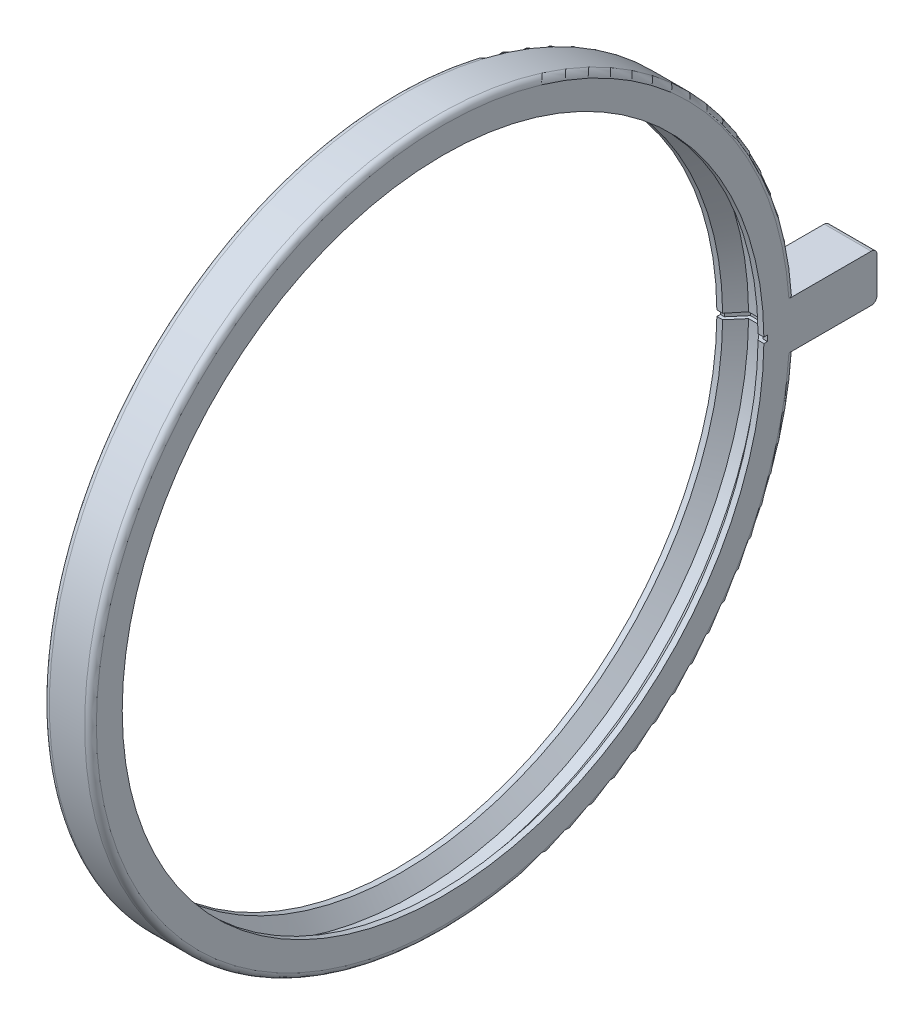
ISO-10303-21;
HEADER;
FILE_DESCRIPTION(('STEP AP214'),'2;1');
FILE_NAME('part.step','',(''),(''),'','','');
FILE_SCHEMA(('AUTOMOTIVE_DESIGN { 1 0 10303 214 1 1 1 1 }'));
ENDSEC;
DATA;
#1=APPLICATION_CONTEXT('core data for automotive mechanical design processes');
#2=APPLICATION_PROTOCOL_DEFINITION('international standard','automotive_design',2000,#1);
#3=PRODUCT_CONTEXT('',#1,'mechanical');
#4=PRODUCT('Part','Part','',(#3));
#5=PRODUCT_RELATED_PRODUCT_CATEGORY('part','',(#4));
#6=PRODUCT_DEFINITION_FORMATION('','',#4);
#7=PRODUCT_DEFINITION_CONTEXT('part definition',#1,'design');
#8=PRODUCT_DEFINITION('design','',#6,#7);
#9=PRODUCT_DEFINITION_SHAPE('','',#8);
#10=(LENGTH_UNIT() NAMED_UNIT(*) SI_UNIT(.MILLI.,.METRE.));
#11=(NAMED_UNIT(*) PLANE_ANGLE_UNIT() SI_UNIT($,.RADIAN.));
#12=(NAMED_UNIT(*) SI_UNIT($,.STERADIAN.) SOLID_ANGLE_UNIT());
#13=UNCERTAINTY_MEASURE_WITH_UNIT(LENGTH_MEASURE(1.E-05),#10,'distance_accuracy_value','');
#14=(GEOMETRIC_REPRESENTATION_CONTEXT(3) GLOBAL_UNCERTAINTY_ASSIGNED_CONTEXT((#13)) GLOBAL_UNIT_ASSIGNED_CONTEXT((#10,
#11,#12)) REPRESENTATION_CONTEXT('',''));
#15=CARTESIAN_POINT('',(0.,0.,0.));
#16=DIRECTION('',(0.,0.,1.));
#17=DIRECTION('',(1.,0.,0.));
#18=AXIS2_PLACEMENT_3D('',#15,#16,#17);
#19=CARTESIAN_POINT('',(0.,0.,0.));
#20=DIRECTION('',(-1.,0.,0.));
#21=DIRECTION('',(0.,0.,1.));
#22=AXIS2_PLACEMENT_3D('',#19,#20,#21);
#23=CYLINDRICAL_SURFACE('',#22,30.);
#24=DIRECTION('',(-1.,0.,0.));
#25=VECTOR('',#24,1.);
#26=CARTESIAN_POINT('',(2.,-2.,-29.9332590941915));
#27=LINE('',#26,#25);
#28=CARTESIAN_POINT('',(1.5,-2.,-29.9332590941915));
#29=VERTEX_POINT('',#28);
#30=CARTESIAN_POINT('',(-1.5,-2.,-29.9332590941915));
#31=VERTEX_POINT('',#30);
#32=EDGE_CURVE('E268',#29,#31,#27,.T.);
#33=ORIENTED_EDGE('',*,*,#32,.F.);
#34=CARTESIAN_POINT('',(1.5,0.,0.));
#35=DIRECTION('',(-1.,0.,0.));
#36=DIRECTION('',(0.,0.,1.));
#37=AXIS2_PLACEMENT_3D('',#34,#35,#36);
#38=CIRCLE('',#37,30.);
#39=CARTESIAN_POINT('',(1.5,2.,-29.9332590941915));
#40=VERTEX_POINT('',#39);
#41=EDGE_CURVE('E314',#29,#40,#38,.T.);
#42=ORIENTED_EDGE('',*,*,#41,.T.);
#43=DIRECTION('',(-1.,0.,0.));
#44=VECTOR('',#43,1.);
#45=CARTESIAN_POINT('',(2.,2.,-29.9332590941915));
#46=LINE('',#45,#44);
#47=CARTESIAN_POINT('',(-1.5,2.,-29.9332590941915));
#48=VERTEX_POINT('',#47);
#49=EDGE_CURVE('E275',#40,#48,#46,.T.);
#50=ORIENTED_EDGE('',*,*,#49,.T.);
#51=CARTESIAN_POINT('',(-1.5,0.,0.));
#52=DIRECTION('',(1.,0.,0.));
#53=DIRECTION('',(0.,0.,-1.));
#54=AXIS2_PLACEMENT_3D('',#51,#52,#53);
#55=CIRCLE('',#54,30.);
#56=EDGE_CURVE('E312',#48,#31,#55,.T.);
#57=ORIENTED_EDGE('',*,*,#56,.T.);
#58=EDGE_LOOP('',(#33,#42,#50,#57));
#59=FACE_BOUND('',#58,.T.);
#60=ADVANCED_FACE('F43',(#59),#23,.T.);
#61=CARTESIAN_POINT('',(0.,0.,0.));
#62=DIRECTION('',(-1.,0.,0.));
#63=DIRECTION('',(0.,0.,1.));
#64=AXIS2_PLACEMENT_3D('',#61,#62,#63);
#65=CYLINDRICAL_SURFACE('',#64,28.5);
#66=DIRECTION('',(1.,0.,0.));
#67=VECTOR('',#66,1.);
#68=CARTESIAN_POINT('',(-0.5,0.248706261703658,-28.4989148073289));
#69=LINE('',#68,#67);
#70=CARTESIAN_POINT('',(-0.5,0.248706261703658,-28.4989148073289));
#71=VERTEX_POINT('',#70);
#72=CARTESIAN_POINT('',(0.5,0.248706261703658,-28.4989148073289));
#73=VERTEX_POINT('',#72);
#74=EDGE_CURVE('E245',#71,#73,#69,.T.);
#75=ORIENTED_EDGE('',*,*,#74,.T.);
#76=CARTESIAN_POINT('',(0.499999999999997,0.,0.));
#77=DIRECTION('',(-1.,0.,0.));
#78=DIRECTION('',(0.,0.,1.));
#79=AXIS2_PLACEMENT_3D('',#76,#77,#78);
#80=CIRCLE('',#79,28.5);
#81=CARTESIAN_POINT('',(0.5,-0.248706261703658,-28.4989148073289));
#82=VERTEX_POINT('',#81);
#83=EDGE_CURVE('E278',#82,#73,#80,.T.);
#84=ORIENTED_EDGE('',*,*,#83,.F.);
#85=DIRECTION('',(1.,0.,0.));
#86=VECTOR('',#85,1.);
#87=CARTESIAN_POINT('',(-0.5,-0.248706261703658,-28.4989148073289));
#88=LINE('',#87,#86);
#89=CARTESIAN_POINT('',(-0.5,-0.248706261703658,-28.4989148073289));
#90=VERTEX_POINT('',#89);
#91=EDGE_CURVE('E226',#90,#82,#88,.T.);
#92=ORIENTED_EDGE('',*,*,#91,.F.);
#93=CARTESIAN_POINT('',(-0.499999999999997,0.,0.));
#94=DIRECTION('',(-1.,0.,0.));
#95=DIRECTION('',(0.,0.,1.));
#96=AXIS2_PLACEMENT_3D('',#93,#94,#95);
#97=CIRCLE('',#96,28.5);
#98=EDGE_CURVE('E286',#90,#71,#97,.T.);
#99=ORIENTED_EDGE('',*,*,#98,.T.);
#100=EDGE_LOOP('',(#75,#84,#92,#99));
#101=FACE_BOUND('',#100,.T.);
#102=ADVANCED_FACE('F353',(#101),#65,.F.);
#103=CARTESIAN_POINT('',(-2.,0.,0.));
#104=DIRECTION('',(1.,0.,0.));
#105=DIRECTION('',(0.,0.,-1.));
#106=AXIS2_PLACEMENT_3D('',#103,#104,#105);
#107=PLANE('',#106);
#108=CARTESIAN_POINT('',(-2.,0.,0.));
#109=DIRECTION('',(1.,0.,0.));
#110=DIRECTION('',(0.,0.,-1.));
#111=AXIS2_PLACEMENT_3D('',#108,#109,#110);
#112=CIRCLE('',#111,29.5);
#113=CARTESIAN_POINT('',(-2.,-2.,-29.4321253055229));
#114=VERTEX_POINT('',#113);
#115=CARTESIAN_POINT('',(-2.,2.,-29.4321253055229));
#116=VERTEX_POINT('',#115);
#117=EDGE_CURVE('E320',#114,#116,#112,.F.);
#118=ORIENTED_EDGE('',*,*,#117,.T.);
#119=DIRECTION('',(0.,0.,1.));
#120=VECTOR('',#119,1.);
#121=CARTESIAN_POINT('',(-2.,2.,-36.9332590941915));
#122=LINE('',#121,#120);
#123=CARTESIAN_POINT('',(-2.,2.,-36.4332590941915));
#124=VERTEX_POINT('',#123);
#125=EDGE_CURVE('E64',#124,#116,#122,.T.);
#126=ORIENTED_EDGE('',*,*,#125,.F.);
#127=CARTESIAN_POINT('',(-2.,1.5,-36.4332590941915));
#128=DIRECTION('',(1.,0.,0.));
#129=DIRECTION('',(0.,0.,-1.));
#130=AXIS2_PLACEMENT_3D('',#127,#128,#129);
#131=CIRCLE('',#130,0.5);
#132=CARTESIAN_POINT('',(-2.,1.5,-36.9332590941915));
#133=VERTEX_POINT('',#132);
#134=EDGE_CURVE('E300',#124,#133,#131,.F.);
#135=ORIENTED_EDGE('',*,*,#134,.T.);
#136=DIRECTION('',(0.,1.,0.));
#137=VECTOR('',#136,1.);
#138=CARTESIAN_POINT('',(-2.,-2.,-36.9332590941915));
#139=LINE('',#138,#137);
#140=CARTESIAN_POINT('',(-2.,-1.5,-36.9332590941915));
#141=VERTEX_POINT('',#140);
#142=EDGE_CURVE('E262',#141,#133,#139,.T.);
#143=ORIENTED_EDGE('',*,*,#142,.F.);
#144=CARTESIAN_POINT('',(-2.,-1.5,-36.4332590941915));
#145=DIRECTION('',(1.,0.,0.));
#146=DIRECTION('',(0.,0.,-1.));
#147=AXIS2_PLACEMENT_3D('',#144,#145,#146);
#148=CIRCLE('',#147,0.5);
#149=CARTESIAN_POINT('',(-2.,-2.,-36.4332590941915));
#150=VERTEX_POINT('',#149);
#151=EDGE_CURVE('E302',#141,#150,#148,.F.);
#152=ORIENTED_EDGE('',*,*,#151,.T.);
#153=DIRECTION('',(0.,0.,-1.));
#154=VECTOR('',#153,1.);
#155=CARTESIAN_POINT('',(-2.,-2.,-29.9332590941915));
#156=LINE('',#155,#154);
#157=EDGE_CURVE('E72',#114,#150,#156,.T.);
#158=ORIENTED_EDGE('',*,*,#157,.F.);
#159=EDGE_LOOP('',(#118,#126,#135,#143,#152,#158));
#160=FACE_BOUND('',#159,.T.);
#161=CARTESIAN_POINT('',(-2.,0.,0.));
#162=DIRECTION('',(-1.,0.,0.));
#163=DIRECTION('',(0.,0.,1.));
#164=AXIS2_PLACEMENT_3D('',#161,#162,#163);
#165=CIRCLE('',#164,27.6);
#166=CARTESIAN_POINT('',(-2.,0.240852379755121,-27.5989490765711));
#167=VERTEX_POINT('',#166);
#168=CARTESIAN_POINT('',(-2.,-0.240852379755121,-27.5989490765711));
#169=VERTEX_POINT('',#168);
#170=EDGE_CURVE('E257',#167,#169,#165,.T.);
#171=ORIENTED_EDGE('',*,*,#170,.F.);
#172=DIRECTION('',(0.,-0.00872653549837396,0.999961923064171));
#173=VECTOR('',#172,1.);
#174=CARTESIAN_POINT('',(-2.,0.240852379755121,-27.5989490765711));
#175=LINE('',#174,#173);
#176=CARTESIAN_POINT('',(-2.,0.238234419105609,-27.2989604996519));
#177=VERTEX_POINT('',#176);
#178=EDGE_CURVE('E236',#167,#177,#175,.T.);
#179=ORIENTED_EDGE('',*,*,#178,.T.);
#180=CARTESIAN_POINT('',(-2.,0.,0.));
#181=DIRECTION('',(-1.,0.,0.));
#182=DIRECTION('',(0.,0.,1.));
#183=AXIS2_PLACEMENT_3D('',#180,#181,#182);
#184=CIRCLE('',#183,27.3);
#185=CARTESIAN_POINT('',(-2.,-0.238234419105609,-27.2989604996519));
#186=VERTEX_POINT('',#185);
#187=EDGE_CURVE('E292',#186,#177,#184,.T.);
#188=ORIENTED_EDGE('',*,*,#187,.F.);
#189=DIRECTION('',(0.,0.00872653549837395,0.999961923064171));
#190=VECTOR('',#189,1.);
#191=CARTESIAN_POINT('',(-2.,-0.240852379755121,-27.5989490765711));
#192=LINE('',#191,#190);
#193=EDGE_CURVE('E215',#169,#186,#192,.T.);
#194=ORIENTED_EDGE('',*,*,#193,.F.);
#195=EDGE_LOOP('',(#171,#179,#188,#194));
#196=FACE_BOUND('',#195,.T.);
#197=ADVANCED_FACE('F356',(#160,#196),#107,.F.);
#198=CARTESIAN_POINT('',(0.,0.,0.));
#199=DIRECTION('',(-1.,0.,0.));
#200=DIRECTION('',(0.,0.,1.));
#201=AXIS2_PLACEMENT_3D('',#198,#199,#200);
#202=CYLINDRICAL_SURFACE('',#201,27.3);
#203=ORIENTED_EDGE('',*,*,#187,.T.);
#204=DIRECTION('',(1.,0.,0.));
#205=VECTOR('',#204,1.);
#206=CARTESIAN_POINT('',(-2.,0.238234419105609,-27.2989604996519));
#207=LINE('',#206,#205);
#208=CARTESIAN_POINT('',(-1.50691955741273,0.238234419105609,-27.2989604996519));
#209=VERTEX_POINT('',#208);
#210=EDGE_CURVE('E239',#177,#209,#207,.T.);
#211=ORIENTED_EDGE('',*,*,#210,.T.);
#212=CARTESIAN_POINT('',(-1.50691955741273,0.,0.));
#213=DIRECTION('',(-1.,0.,0.));
#214=DIRECTION('',(0.,0.,1.));
#215=AXIS2_PLACEMENT_3D('',#212,#213,#214);
#216=CIRCLE('',#215,27.3);
#217=CARTESIAN_POINT('',(-1.50691955741273,-0.238234419105609,-27.2989604996519));
#218=VERTEX_POINT('',#217);
#219=EDGE_CURVE('E289',#218,#209,#216,.T.);
#220=ORIENTED_EDGE('',*,*,#219,.F.);
#221=DIRECTION('',(1.,0.,0.));
#222=VECTOR('',#221,1.);
#223=CARTESIAN_POINT('',(-2.,-0.238234419105609,-27.2989604996519));
#224=LINE('',#223,#222);
#225=EDGE_CURVE('E222',#186,#218,#224,.T.);
#226=ORIENTED_EDGE('',*,*,#225,.F.);
#227=EDGE_LOOP('',(#203,#211,#220,#226));
#228=FACE_BOUND('',#227,.T.);
#229=ADVANCED_FACE('F363',(#228),#202,.F.);
#230=CARTESIAN_POINT('',(-1.50691955741273,0.,0.));
#231=DIRECTION('',(1.,0.,0.));
#232=DIRECTION('',(0.,0.,-1.));
#233=AXIS2_PLACEMENT_3D('',#230,#231,#232);
#234=CONICAL_SURFACE('',#233,27.3,0.872664625997165);
#235=ORIENTED_EDGE('',*,*,#219,.T.);
#236=DIRECTION('',(0.642787609686538,0.00668491402620988,-0.766015274493877));
#237=VECTOR('',#236,1.);
#238=CARTESIAN_POINT('',(-1.50691955741273,0.238234419105609,-27.2989604996519));
#239=LINE('',#238,#237);
#240=EDGE_CURVE('E242',#209,#71,#239,.T.);
#241=ORIENTED_EDGE('',*,*,#240,.T.);
#242=ORIENTED_EDGE('',*,*,#98,.F.);
#243=DIRECTION('',(0.642787609686538,-0.00668491402620988,-0.766015274493877));
#244=VECTOR('',#243,1.);
#245=CARTESIAN_POINT('',(-1.50691955741273,-0.238234419105609,-27.2989604996519));
#246=LINE('',#245,#244);
#247=EDGE_CURVE('E224',#218,#90,#246,.T.);
#248=ORIENTED_EDGE('',*,*,#247,.F.);
#249=EDGE_LOOP('',(#235,#241,#242,#248));
#250=FACE_BOUND('',#249,.T.);
#251=ADVANCED_FACE('F366',(#250),#234,.F.);
#252=CARTESIAN_POINT('',(2.,0.,0.));
#253=DIRECTION('',(-1.,0.,0.));
#254=DIRECTION('',(0.,0.,-1.));
#255=AXIS2_PLACEMENT_3D('',#252,#253,#254);
#256=PLANE('',#255);
#257=DIRECTION('',(0.,0.,1.));
#258=VECTOR('',#257,1.);
#259=CARTESIAN_POINT('',(2.,2.,-36.9332590941915));
#260=LINE('',#259,#258);
#261=CARTESIAN_POINT('',(2.,2.,-36.4332590941915));
#262=VERTEX_POINT('',#261);
#263=CARTESIAN_POINT('',(2.,2.,-29.4321253055229));
#264=VERTEX_POINT('',#263);
#265=EDGE_CURVE('E259',#262,#264,#260,.T.);
#266=ORIENTED_EDGE('',*,*,#265,.T.);
#267=CARTESIAN_POINT('',(2.,0.,0.));
#268=DIRECTION('',(-1.,0.,0.));
#269=DIRECTION('',(0.,0.,1.));
#270=AXIS2_PLACEMENT_3D('',#267,#268,#269);
#271=CIRCLE('',#270,29.5);
#272=CARTESIAN_POINT('',(2.,-2.,-29.4321253055229));
#273=VERTEX_POINT('',#272);
#274=EDGE_CURVE('E317',#264,#273,#271,.F.);
#275=ORIENTED_EDGE('',*,*,#274,.T.);
#276=DIRECTION('',(0.,0.,-1.));
#277=VECTOR('',#276,1.);
#278=CARTESIAN_POINT('',(2.,-2.,-29.9332590941915));
#279=LINE('',#278,#277);
#280=CARTESIAN_POINT('',(2.,-2.,-36.4332590941915));
#281=VERTEX_POINT('',#280);
#282=EDGE_CURVE('E261',#273,#281,#279,.T.);
#283=ORIENTED_EDGE('',*,*,#282,.T.);
#284=CARTESIAN_POINT('',(2.,-1.5,-36.4332590941915));
#285=DIRECTION('',(-1.,0.,0.));
#286=DIRECTION('',(0.,0.,1.));
#287=AXIS2_PLACEMENT_3D('',#284,#285,#286);
#288=CIRCLE('',#287,0.5);
#289=CARTESIAN_POINT('',(2.,-1.5,-36.9332590941915));
#290=VERTEX_POINT('',#289);
#291=EDGE_CURVE('E308',#281,#290,#288,.F.);
#292=ORIENTED_EDGE('',*,*,#291,.T.);
#293=DIRECTION('',(0.,1.,0.));
#294=VECTOR('',#293,1.);
#295=CARTESIAN_POINT('',(2.,-2.,-36.9332590941915));
#296=LINE('',#295,#294);
#297=CARTESIAN_POINT('',(2.,1.5,-36.9332590941915));
#298=VERTEX_POINT('',#297);
#299=EDGE_CURVE('E265',#290,#298,#296,.T.);
#300=ORIENTED_EDGE('',*,*,#299,.T.);
#301=CARTESIAN_POINT('',(2.,1.5,-36.4332590941915));
#302=DIRECTION('',(-1.,0.,0.));
#303=DIRECTION('',(0.,0.,1.));
#304=AXIS2_PLACEMENT_3D('',#301,#302,#303);
#305=CIRCLE('',#304,0.5);
#306=EDGE_CURVE('E306',#298,#262,#305,.F.);
#307=ORIENTED_EDGE('',*,*,#306,.T.);
#308=EDGE_LOOP('',(#266,#275,#283,#292,#300,#307));
#309=FACE_BOUND('',#308,.T.);
#310=CARTESIAN_POINT('',(2.,0.,0.));
#311=DIRECTION('',(-1.,0.,0.));
#312=DIRECTION('',(0.,0.,1.));
#313=AXIS2_PLACEMENT_3D('',#310,#311,#312);
#314=CIRCLE('',#313,27.3);
#315=CARTESIAN_POINT('',(2.,-0.238234419105609,-27.2989604996519));
#316=VERTEX_POINT('',#315);
#317=CARTESIAN_POINT('',(2.,0.238234419105609,-27.2989604996519));
#318=VERTEX_POINT('',#317);
#319=EDGE_CURVE('E281',#316,#318,#314,.T.);
#320=ORIENTED_EDGE('',*,*,#319,.T.);
#321=DIRECTION('',(0.,-0.00872653549837396,0.999961923064171));
#322=VECTOR('',#321,1.);
#323=CARTESIAN_POINT('',(2.,0.240852379755121,-27.5989490765711));
#324=LINE('',#323,#322);
#325=CARTESIAN_POINT('',(2.,0.240852379755121,-27.5989490765711));
#326=VERTEX_POINT('',#325);
#327=EDGE_CURVE('E211',#326,#318,#324,.T.);
#328=ORIENTED_EDGE('',*,*,#327,.F.);
#329=CARTESIAN_POINT('',(2.,0.,0.));
#330=DIRECTION('',(-1.,0.,0.));
#331=DIRECTION('',(0.,0.,1.));
#332=AXIS2_PLACEMENT_3D('',#329,#330,#331);
#333=CIRCLE('',#332,27.6);
#334=CARTESIAN_POINT('',(2.,-0.240852379755121,-27.5989490765711));
#335=VERTEX_POINT('',#334);
#336=EDGE_CURVE('E205',#326,#335,#333,.T.);
#337=ORIENTED_EDGE('',*,*,#336,.T.);
#338=DIRECTION('',(0.,0.00872653549837395,0.999961923064171));
#339=VECTOR('',#338,1.);
#340=CARTESIAN_POINT('',(2.,-0.240852379755121,-27.5989490765711));
#341=LINE('',#340,#339);
#342=EDGE_CURVE('E187',#335,#316,#341,.T.);
#343=ORIENTED_EDGE('',*,*,#342,.T.);
#344=EDGE_LOOP('',(#320,#328,#337,#343));
#345=FACE_BOUND('',#344,.T.);
#346=ADVANCED_FACE('F210',(#309,#345),#256,.F.);
#347=CARTESIAN_POINT('',(0.,0.,0.));
#348=DIRECTION('',(1.,0.,0.));
#349=DIRECTION('',(0.,0.,1.));
#350=AXIS2_PLACEMENT_3D('',#347,#348,#349);
#351=CYLINDRICAL_SURFACE('',#350,27.3);
#352=CARTESIAN_POINT('',(1.50691955741273,0.,0.));
#353=DIRECTION('',(-1.,0.,0.));
#354=DIRECTION('',(0.,0.,1.));
#355=AXIS2_PLACEMENT_3D('',#352,#353,#354);
#356=CIRCLE('',#355,27.3);
#357=CARTESIAN_POINT('',(1.50691955741273,-0.238234419105609,-27.2989604996519));
#358=VERTEX_POINT('',#357);
#359=CARTESIAN_POINT('',(1.50691955741273,0.238234419105609,-27.2989604996519));
#360=VERTEX_POINT('',#359);
#361=EDGE_CURVE('E283',#358,#360,#356,.T.);
#362=ORIENTED_EDGE('',*,*,#361,.T.);
#363=DIRECTION('',(-1.,0.,0.));
#364=VECTOR('',#363,1.);
#365=CARTESIAN_POINT('',(2.,0.238234419105609,-27.2989604996519));
#366=LINE('',#365,#364);
#367=EDGE_CURVE('E444',#318,#360,#366,.T.);
#368=ORIENTED_EDGE('',*,*,#367,.F.);
#369=ORIENTED_EDGE('',*,*,#319,.F.);
#370=DIRECTION('',(-1.,0.,0.));
#371=VECTOR('',#370,1.);
#372=CARTESIAN_POINT('',(2.,-0.238234419105609,-27.2989604996519));
#373=LINE('',#372,#371);
#374=EDGE_CURVE('E194',#316,#358,#373,.T.);
#375=ORIENTED_EDGE('',*,*,#374,.T.);
#376=EDGE_LOOP('',(#362,#368,#369,#375));
#377=FACE_BOUND('',#376,.T.);
#378=ADVANCED_FACE('F374',(#377),#351,.F.);
#379=CARTESIAN_POINT('',(1.50691955741273,0.,0.));
#380=DIRECTION('',(-1.,0.,0.));
#381=DIRECTION('',(0.,0.,-1.));
#382=AXIS2_PLACEMENT_3D('',#379,#380,#381);
#383=CONICAL_SURFACE('',#382,27.3,0.872664625997165);
#384=ORIENTED_EDGE('',*,*,#83,.T.);
#385=DIRECTION('',(-0.642787609686538,0.00668491402620988,-0.766015274493877));
#386=VECTOR('',#385,1.);
#387=CARTESIAN_POINT('',(1.50691955741273,0.238234419105609,-27.2989604996519));
#388=LINE('',#387,#386);
#389=EDGE_CURVE('E434',#360,#73,#388,.T.);
#390=ORIENTED_EDGE('',*,*,#389,.F.);
#391=ORIENTED_EDGE('',*,*,#361,.F.);
#392=DIRECTION('',(-0.642787609686538,-0.00668491402620988,-0.766015274493877));
#393=VECTOR('',#392,1.);
#394=CARTESIAN_POINT('',(1.50691955741273,-0.238234419105609,-27.2989604996519));
#395=LINE('',#394,#393);
#396=EDGE_CURVE('E435',#358,#82,#395,.T.);
#397=ORIENTED_EDGE('',*,*,#396,.T.);
#398=EDGE_LOOP('',(#384,#390,#391,#397));
#399=FACE_BOUND('',#398,.T.);
#400=ADVANCED_FACE('F371',(#399),#383,.F.);
#401=CARTESIAN_POINT('',(2.,2.,-36.9332590941915));
#402=DIRECTION('',(0.,-1.,0.));
#403=DIRECTION('',(0.,0.,-1.));
#404=AXIS2_PLACEMENT_3D('',#401,#402,#403);
#405=PLANE('',#404);
#406=ORIENTED_EDGE('',*,*,#265,.F.);
#407=DIRECTION('',(-1.,0.,0.));
#408=VECTOR('',#407,1.);
#409=CARTESIAN_POINT('',(2.,2.,-36.4332590941915));
#410=LINE('',#409,#408);
#411=EDGE_CURVE('E310',#262,#124,#410,.T.);
#412=ORIENTED_EDGE('',*,*,#411,.T.);
#413=ORIENTED_EDGE('',*,*,#125,.T.);
#414=CARTESIAN_POINT('',(-2.,2.,-29.4321253055229));
#415=CARTESIAN_POINT('',(-2.00002368069256,2.,-29.4603651042107));
#416=CARTESIAN_POINT('',(-1.997619942337,2.,-29.4885981664758));
#417=CARTESIAN_POINT('',(-1.98813168582598,2.,-29.5442466715054));
#418=CARTESIAN_POINT('',(-1.98105052269843,2.,-29.5716626856027));
#419=CARTESIAN_POINT('',(-1.96237630800987,2.,-29.6249290951014));
#420=CARTESIAN_POINT('',(-1.95078098189146,2.,-29.6507786936306));
#421=CARTESIAN_POINT('',(-1.92341435274997,2.,-29.7001569691344));
#422=CARTESIAN_POINT('',(-1.9076438659856,2.,-29.7236860985361));
#423=CARTESIAN_POINT('',(-1.87238775839565,2.,-29.7677324573108));
#424=CARTESIAN_POINT('',(-1.8529061081985,2.,-29.7882528646071));
#425=CARTESIAN_POINT('',(-1.81076303958688,2.,-29.8257273757368));
#426=CARTESIAN_POINT('',(-1.78810101311991,2.,-29.8426807960494));
#427=CARTESIAN_POINT('',(-1.74029420356309,2.,-29.8724983842107));
#428=CARTESIAN_POINT('',(-1.71515434768272,2.,-29.885370461107));
#429=CARTESIAN_POINT('',(-1.66307266133581,2.,-29.9066947635916));
#430=CARTESIAN_POINT('',(-1.63613195532413,2.,-29.9151497186943));
#431=CARTESIAN_POINT('',(-1.59085023209029,2.,-29.9252585600438));
#432=CARTESIAN_POINT('',(-1.57279801700389,2.,-29.9282569553729));
#433=CARTESIAN_POINT('',(-1.53649976818814,2.,-29.9322569250276));
#434=CARTESIAN_POINT('',(-1.51825404680307,2.,-29.9332613346435));
#435=CARTESIAN_POINT('',(-1.5,2.,-29.9332590941915));
#436=B_SPLINE_CURVE_WITH_KNOTS('',3,(#414,#415,#416,#417,#418,#419,#420,#421,#422,#423,#424,
#425,#426,#427,#428,#429,#430,#431,#432,#433,#434,#435),.UNSPECIFIED.,.F.,.F.,(4,2,2,2,2,2,2,2,
2,2,4),(0.,0.0846076997384342,0.169154777785782,0.253744511935921,0.338317720690022,
0.422800946435936,0.507300346493675,0.591634983838948,0.675917445648952,0.730713729796034,
0.785432041982399),.UNSPECIFIED.);
#437=EDGE_CURVE('E57',#116,#48,#436,.T.);
#438=ORIENTED_EDGE('',*,*,#437,.T.);
#439=ORIENTED_EDGE('',*,*,#49,.F.);
#440=CARTESIAN_POINT('',(1.5,2.,-29.9332590941915));
#441=CARTESIAN_POINT('',(1.52808358512867,2.,-29.9332832437374));
#442=CARTESIAN_POINT('',(1.55615966573787,2.,-29.9308892111206));
#443=CARTESIAN_POINT('',(1.61149371123091,2.,-29.9214434219722));
#444=CARTESIAN_POINT('',(1.63875234909917,2.,-29.9143956133538));
#445=CARTESIAN_POINT('',(1.69171077903689,2.,-29.8958160962011));
#446=CARTESIAN_POINT('',(1.71740984993781,2.,-29.8842823312807));
#447=CARTESIAN_POINT('',(1.76650569184914,2.,-29.8570715289327));
#448=CARTESIAN_POINT('',(1.78990282711411,2.,-29.8413951484776));
#449=CARTESIAN_POINT('',(1.83376101079415,2.,-29.8063271682228));
#450=CARTESIAN_POINT('',(1.85421920488227,2.,-29.7869319988048));
#451=CARTESIAN_POINT('',(1.8916014369025,2.,-29.7449844406582));
#452=CARTESIAN_POINT('',(1.90852476901737,2.,-29.7224314228907));
#453=CARTESIAN_POINT('',(1.93839251755083,2.,-29.6747590926006));
#454=CARTESIAN_POINT('',(1.95132769216377,2.,-29.6496339964351));
#455=CARTESIAN_POINT('',(1.97279971423696,2.,-29.5975765312386));
#456=CARTESIAN_POINT('',(1.98133899403255,2.,-29.5706451709941));
#457=CARTESIAN_POINT('',(1.99169618288635,2.,-29.5249837042404));
#458=CARTESIAN_POINT('',(1.99480824528633,2.,-29.5065366439966));
#459=CARTESIAN_POINT('',(1.99895991135017,2.,-29.4694373513958));
#460=CARTESIAN_POINT('',(2.00000245127979,2.,-29.4507854475362));
#461=CARTESIAN_POINT('',(2.,2.,-29.4321253055229));
#462=B_SPLINE_CURVE_WITH_KNOTS('',3,(#440,#441,#442,#443,#444,#445,#446,#447,#448,#449,#450,
#451,#452,#453,#454,#455,#456,#457,#458,#459,#460,#461),.UNSPECIFIED.,.F.,.F.,(4,2,2,2,2,2,2,2,
2,2,4),(0.,0.0841380740530654,0.168204863238539,0.252310234592144,0.336402275770863,
0.420575443631008,0.504765402585072,0.589149014530635,0.673485885036206,0.729500703388647,
0.785435990212467),.UNSPECIFIED.);
#463=EDGE_CURVE('E322',#40,#264,#462,.T.);
#464=ORIENTED_EDGE('',*,*,#463,.T.);
#465=EDGE_LOOP('',(#406,#412,#413,#438,#439,#464));
#466=FACE_BOUND('',#465,.T.);
#467=ADVANCED_FACE('F335',(#466),#405,.F.);
#468=CARTESIAN_POINT('',(2.,-2.,-29.9332590941915));
#469=DIRECTION('',(0.,1.,0.));
#470=DIRECTION('',(0.,0.,1.));
#471=AXIS2_PLACEMENT_3D('',#468,#469,#470);
#472=PLANE('',#471);
#473=ORIENTED_EDGE('',*,*,#157,.T.);
#474=DIRECTION('',(-1.,0.,0.));
#475=VECTOR('',#474,1.);
#476=CARTESIAN_POINT('',(2.,-2.,-36.4332590941915));
#477=LINE('',#476,#475);
#478=EDGE_CURVE('E304',#150,#281,#477,.F.);
#479=ORIENTED_EDGE('',*,*,#478,.T.);
#480=ORIENTED_EDGE('',*,*,#282,.F.);
#481=CARTESIAN_POINT('',(2.,-2.,-29.4321253055229));
#482=CARTESIAN_POINT('',(2.00002368069256,-2.,-29.4603651042107));
#483=CARTESIAN_POINT('',(1.997619942337,-2.,-29.4885981664758));
#484=CARTESIAN_POINT('',(1.98813168582598,-2.,-29.5442466715054));
#485=CARTESIAN_POINT('',(1.98105052269843,-2.,-29.5716626856027));
#486=CARTESIAN_POINT('',(1.96237630800987,-2.,-29.6249290951014));
#487=CARTESIAN_POINT('',(1.95078098189146,-2.,-29.6507786936306));
#488=CARTESIAN_POINT('',(1.92341435274997,-2.,-29.7001569691344));
#489=CARTESIAN_POINT('',(1.9076438659856,-2.,-29.7236860985361));
#490=CARTESIAN_POINT('',(1.87238775839565,-2.,-29.7677324573108));
#491=CARTESIAN_POINT('',(1.8529061081985,-2.,-29.7882528646071));
#492=CARTESIAN_POINT('',(1.81076303958688,-2.,-29.8257273757368));
#493=CARTESIAN_POINT('',(1.78810101311991,-2.,-29.8426807960494));
#494=CARTESIAN_POINT('',(1.74029420356309,-2.,-29.8724983842107));
#495=CARTESIAN_POINT('',(1.71515434768272,-2.,-29.885370461107));
#496=CARTESIAN_POINT('',(1.66307266133581,-2.,-29.9066947635916));
#497=CARTESIAN_POINT('',(1.63613195532413,-2.,-29.9151497186943));
#498=CARTESIAN_POINT('',(1.59085023209029,-2.,-29.9252585600438));
#499=CARTESIAN_POINT('',(1.57279801700389,-2.,-29.9282569553729));
#500=CARTESIAN_POINT('',(1.53649976818814,-2.,-29.9322569250276));
#501=CARTESIAN_POINT('',(1.51825404680307,-2.,-29.9332613346435));
#502=CARTESIAN_POINT('',(1.5,-2.,-29.9332590941915));
#503=B_SPLINE_CURVE_WITH_KNOTS('',3,(#481,#482,#483,#484,#485,#486,#487,#488,#489,#490,#491,
#492,#493,#494,#495,#496,#497,#498,#499,#500,#501,#502),.UNSPECIFIED.,.F.,.F.,(4,2,2,2,2,2,2,2,
2,2,4),(0.,0.0846076997384342,0.169154777785782,0.253744511935921,0.338317720690022,
0.422800946435936,0.507300346493675,0.591634983838948,0.675917445648952,0.730713729796034,
0.785432041982399),.UNSPECIFIED.);
#504=EDGE_CURVE('E330',#273,#29,#503,.T.);
#505=ORIENTED_EDGE('',*,*,#504,.T.);
#506=ORIENTED_EDGE('',*,*,#32,.T.);
#507=CARTESIAN_POINT('',(-1.5,-2.,-29.9332590941915));
#508=CARTESIAN_POINT('',(-1.52808358512867,-2.,-29.9332832437374));
#509=CARTESIAN_POINT('',(-1.55615966573787,-2.,-29.9308892111206));
#510=CARTESIAN_POINT('',(-1.61149371123091,-2.,-29.9214434219722));
#511=CARTESIAN_POINT('',(-1.63875234909917,-2.,-29.9143956133538));
#512=CARTESIAN_POINT('',(-1.69171077903689,-2.,-29.8958160962011));
#513=CARTESIAN_POINT('',(-1.71740984993781,-2.,-29.8842823312807));
#514=CARTESIAN_POINT('',(-1.76650569184914,-2.,-29.8570715289327));
#515=CARTESIAN_POINT('',(-1.78990282711411,-2.,-29.8413951484776));
#516=CARTESIAN_POINT('',(-1.83376101079415,-2.,-29.8063271682228));
#517=CARTESIAN_POINT('',(-1.85421920488227,-2.,-29.7869319988048));
#518=CARTESIAN_POINT('',(-1.8916014369025,-2.,-29.7449844406582));
#519=CARTESIAN_POINT('',(-1.90852476901737,-2.,-29.7224314228907));
#520=CARTESIAN_POINT('',(-1.93839251755083,-2.,-29.6747590926006));
#521=CARTESIAN_POINT('',(-1.95132769216377,-2.,-29.6496339964351));
#522=CARTESIAN_POINT('',(-1.97279971423696,-2.,-29.5975765312386));
#523=CARTESIAN_POINT('',(-1.98133899403255,-2.,-29.5706451709941));
#524=CARTESIAN_POINT('',(-1.99169618288635,-2.,-29.5249837042404));
#525=CARTESIAN_POINT('',(-1.99480824528633,-2.,-29.5065366439966));
#526=CARTESIAN_POINT('',(-1.99895991135017,-2.,-29.4694373513958));
#527=CARTESIAN_POINT('',(-2.00000245127979,-2.,-29.4507854475362));
#528=CARTESIAN_POINT('',(-2.,-2.,-29.4321253055229));
#529=B_SPLINE_CURVE_WITH_KNOTS('',3,(#507,#508,#509,#510,#511,#512,#513,#514,#515,#516,#517,
#518,#519,#520,#521,#522,#523,#524,#525,#526,#527,#528),.UNSPECIFIED.,.F.,.F.,(4,2,2,2,2,2,2,2,
2,2,4),(0.,0.0841380740530654,0.168204863238539,0.252310234592144,0.336402275770863,
0.420575443631008,0.504765402585072,0.589149014530635,0.673485885036206,0.729500703388647,
0.785435990212467),.UNSPECIFIED.);
#530=EDGE_CURVE('E11',#31,#114,#529,.T.);
#531=ORIENTED_EDGE('',*,*,#530,.T.);
#532=EDGE_LOOP('',(#473,#479,#480,#505,#506,#531));
#533=FACE_BOUND('',#532,.T.);
#534=ADVANCED_FACE('F400',(#533),#472,.F.);
#535=CARTESIAN_POINT('',(2.,-2.,-36.9332590941915));
#536=DIRECTION('',(0.,0.,1.));
#537=DIRECTION('',(1.,0.,0.));
#538=AXIS2_PLACEMENT_3D('',#535,#536,#537);
#539=PLANE('',#538);
#540=ORIENTED_EDGE('',*,*,#299,.F.);
#541=DIRECTION('',(-1.,0.,0.));
#542=VECTOR('',#541,1.);
#543=CARTESIAN_POINT('',(2.,-1.5,-36.9332590941915));
#544=LINE('',#543,#542);
#545=EDGE_CURVE('E297',#290,#141,#544,.T.);
#546=ORIENTED_EDGE('',*,*,#545,.T.);
#547=ORIENTED_EDGE('',*,*,#142,.T.);
#548=DIRECTION('',(-1.,0.,0.));
#549=VECTOR('',#548,1.);
#550=CARTESIAN_POINT('',(2.,1.5,-36.9332590941915));
#551=LINE('',#550,#549);
#552=EDGE_CURVE('E295',#133,#298,#551,.F.);
#553=ORIENTED_EDGE('',*,*,#552,.T.);
#554=EDGE_LOOP('',(#540,#546,#547,#553));
#555=FACE_BOUND('',#554,.T.);
#556=ADVANCED_FACE('F406',(#555),#539,.F.);
#557=CARTESIAN_POINT('',(0.,0.,0.));
#558=DIRECTION('',(-1.,0.,0.));
#559=DIRECTION('',(0.,0.,1.));
#560=AXIS2_PLACEMENT_3D('',#557,#558,#559);
#561=CYLINDRICAL_SURFACE('',#560,27.6);
#562=ORIENTED_EDGE('',*,*,#170,.T.);
#563=DIRECTION('',(-1.,0.,0.));
#564=VECTOR('',#563,1.);
#565=CARTESIAN_POINT('',(-1.64681185485923,-0.240852379755121,-27.5989490765711));
#566=LINE('',#565,#564);
#567=CARTESIAN_POINT('',(-1.64681185485923,-0.240852379755121,-27.5989490765711));
#568=VERTEX_POINT('',#567);
#569=EDGE_CURVE('E212',#568,#169,#566,.T.);
#570=ORIENTED_EDGE('',*,*,#569,.F.);
#571=CARTESIAN_POINT('',(-1.64681185485923,0.,0.));
#572=DIRECTION('',(-1.,0.,0.));
#573=DIRECTION('',(0.,0.,1.));
#574=AXIS2_PLACEMENT_3D('',#571,#572,#573);
#575=CIRCLE('',#574,27.6);
#576=CARTESIAN_POINT('',(-1.64681185485923,0.240852379755121,-27.5989490765711));
#577=VERTEX_POINT('',#576);
#578=EDGE_CURVE('E253',#577,#568,#575,.T.);
#579=ORIENTED_EDGE('',*,*,#578,.F.);
#580=DIRECTION('',(-1.,0.,0.));
#581=VECTOR('',#580,1.);
#582=CARTESIAN_POINT('',(-1.64681185485923,0.240852379755121,-27.5989490765711));
#583=LINE('',#582,#581);
#584=EDGE_CURVE('E234',#577,#167,#583,.T.);
#585=ORIENTED_EDGE('',*,*,#584,.T.);
#586=EDGE_LOOP('',(#562,#570,#579,#585));
#587=FACE_BOUND('',#586,.T.);
#588=ADVANCED_FACE('F416',(#587),#561,.F.);
#589=CARTESIAN_POINT('',(0.,0.,0.));
#590=DIRECTION('',(-1.,0.,0.));
#591=DIRECTION('',(0.,0.,1.));
#592=AXIS2_PLACEMENT_3D('',#589,#590,#591);
#593=CYLINDRICAL_SURFACE('',#592,28.8);
#594=CARTESIAN_POINT('',(-0.639892297446499,0.,0.));
#595=DIRECTION('',(-1.,0.,0.));
#596=DIRECTION('',(0.,0.,1.));
#597=AXIS2_PLACEMENT_3D('',#594,#595,#596);
#598=CIRCLE('',#597,28.8);
#599=CARTESIAN_POINT('',(-0.639892297446499,0.25132422235317,-28.7989033842481));
#600=VERTEX_POINT('',#599);
#601=CARTESIAN_POINT('',(-0.639892297446499,-0.25132422235317,-28.7989033842481));
#602=VERTEX_POINT('',#601);
#603=EDGE_CURVE('E255',#600,#602,#598,.T.);
#604=ORIENTED_EDGE('',*,*,#603,.T.);
#605=DIRECTION('',(-1.,0.,0.));
#606=VECTOR('',#605,1.);
#607=CARTESIAN_POINT('',(0.,-0.25132422235317,-28.7989033842481));
#608=LINE('',#607,#606);
#609=CARTESIAN_POINT('',(0.639892297446499,-0.25132422235317,-28.7989033842481));
#610=VERTEX_POINT('',#609);
#611=EDGE_CURVE('E228',#610,#602,#608,.T.);
#612=ORIENTED_EDGE('',*,*,#611,.F.);
#613=CARTESIAN_POINT('',(0.639892297446499,0.,0.));
#614=DIRECTION('',(-1.,0.,0.));
#615=DIRECTION('',(0.,0.,1.));
#616=AXIS2_PLACEMENT_3D('',#613,#614,#615);
#617=CIRCLE('',#616,28.8);
#618=CARTESIAN_POINT('',(0.639892297446499,0.25132422235317,-28.7989033842481));
#619=VERTEX_POINT('',#618);
#620=EDGE_CURVE('E213',#619,#610,#617,.T.);
#621=ORIENTED_EDGE('',*,*,#620,.F.);
#622=DIRECTION('',(-1.,0.,0.));
#623=VECTOR('',#622,1.);
#624=CARTESIAN_POINT('',(0.,0.25132422235317,-28.7989033842481));
#625=LINE('',#624,#623);
#626=EDGE_CURVE('E247',#619,#600,#625,.T.);
#627=ORIENTED_EDGE('',*,*,#626,.T.);
#628=EDGE_LOOP('',(#604,#612,#621,#627));
#629=FACE_BOUND('',#628,.T.);
#630=ADVANCED_FACE('F452',(#629),#593,.F.);
#631=CARTESIAN_POINT('',(-0.639892297446499,0.,0.));
#632=DIRECTION('',(1.,0.,0.));
#633=DIRECTION('',(0.,0.,-1.));
#634=AXIS2_PLACEMENT_3D('',#631,#632,#633);
#635=CONICAL_SURFACE('',#634,28.8,0.872664625997168);
#636=DIRECTION('',(-0.642787609686538,-0.00668491402620988,0.766015274493877));
#637=VECTOR('',#636,1.);
#638=CARTESIAN_POINT('',(-0.639892297446499,0.25132422235317,-28.7989033842481));
#639=LINE('',#638,#637);
#640=EDGE_CURVE('E250',#600,#577,#639,.T.);
#641=ORIENTED_EDGE('',*,*,#640,.T.);
#642=ORIENTED_EDGE('',*,*,#578,.T.);
#643=DIRECTION('',(-0.642787609686538,0.00668491402620988,0.766015274493877));
#644=VECTOR('',#643,1.);
#645=CARTESIAN_POINT('',(-0.639892297446499,-0.25132422235317,-28.7989033842481));
#646=LINE('',#645,#644);
#647=EDGE_CURVE('E231',#602,#568,#646,.T.);
#648=ORIENTED_EDGE('',*,*,#647,.F.);
#649=ORIENTED_EDGE('',*,*,#603,.F.);
#650=EDGE_LOOP('',(#641,#642,#648,#649));
#651=FACE_BOUND('',#650,.T.);
#652=ADVANCED_FACE('F421',(#651),#635,.F.);
#653=CARTESIAN_POINT('',(0.,0.,0.));
#654=DIRECTION('',(0.,0.999961923064171,0.00872653549837396));
#655=DIRECTION('',(0.,-0.00872653549837396,0.999961923064171));
#656=AXIS2_PLACEMENT_3D('',#653,#654,#655);
#657=PLANE('',#656);
#658=ORIENTED_EDGE('',*,*,#584,.F.);
#659=ORIENTED_EDGE('',*,*,#640,.F.);
#660=ORIENTED_EDGE('',*,*,#626,.F.);
#661=DIRECTION('',(0.642787609686538,-0.00668491402620988,0.766015274493877));
#662=VECTOR('',#661,1.);
#663=CARTESIAN_POINT('',(0.639892297446499,0.25132422235317,-28.7989033842481));
#664=LINE('',#663,#662);
#665=CARTESIAN_POINT('',(1.64681185485923,0.240852379755121,-27.5989490765711));
#666=VERTEX_POINT('',#665);
#667=EDGE_CURVE('E447',#619,#666,#664,.T.);
#668=ORIENTED_EDGE('',*,*,#667,.T.);
#669=DIRECTION('',(1.,0.,0.));
#670=VECTOR('',#669,1.);
#671=CARTESIAN_POINT('',(1.64681185485923,0.240852379755121,-27.5989490765711));
#672=LINE('',#671,#670);
#673=EDGE_CURVE('E438',#666,#326,#672,.T.);
#674=ORIENTED_EDGE('',*,*,#673,.T.);
#675=ORIENTED_EDGE('',*,*,#327,.T.);
#676=ORIENTED_EDGE('',*,*,#367,.T.);
#677=ORIENTED_EDGE('',*,*,#389,.T.);
#678=ORIENTED_EDGE('',*,*,#74,.F.);
#679=ORIENTED_EDGE('',*,*,#240,.F.);
#680=ORIENTED_EDGE('',*,*,#210,.F.);
#681=ORIENTED_EDGE('',*,*,#178,.F.);
#682=EDGE_LOOP('',(#658,#659,#660,#668,#674,#675,#676,#677,#678,#679,#680,#681));
#683=FACE_BOUND('',#682,.T.);
#684=ADVANCED_FACE('F424',(#683),#657,.F.);
#685=CARTESIAN_POINT('',(0.,0.,0.));
#686=DIRECTION('',(0.,0.999961923064171,-0.00872653549837395));
#687=DIRECTION('',(0.,0.00872653549837395,0.999961923064171));
#688=AXIS2_PLACEMENT_3D('',#685,#686,#687);
#689=PLANE('',#688);
#690=ORIENTED_EDGE('',*,*,#569,.T.);
#691=ORIENTED_EDGE('',*,*,#193,.T.);
#692=ORIENTED_EDGE('',*,*,#225,.T.);
#693=ORIENTED_EDGE('',*,*,#247,.T.);
#694=ORIENTED_EDGE('',*,*,#91,.T.);
#695=ORIENTED_EDGE('',*,*,#396,.F.);
#696=ORIENTED_EDGE('',*,*,#374,.F.);
#697=ORIENTED_EDGE('',*,*,#342,.F.);
#698=DIRECTION('',(1.,0.,0.));
#699=VECTOR('',#698,1.);
#700=CARTESIAN_POINT('',(1.64681185485923,-0.240852379755121,-27.5989490765711));
#701=LINE('',#700,#699);
#702=CARTESIAN_POINT('',(1.64681185485923,-0.240852379755121,-27.5989490765711));
#703=VERTEX_POINT('',#702);
#704=EDGE_CURVE('E192',#703,#335,#701,.T.);
#705=ORIENTED_EDGE('',*,*,#704,.F.);
#706=DIRECTION('',(0.642787609686538,0.00668491402620988,0.766015274493877));
#707=VECTOR('',#706,1.);
#708=CARTESIAN_POINT('',(0.639892297446499,-0.25132422235317,-28.7989033842481));
#709=LINE('',#708,#707);
#710=EDGE_CURVE('E436',#610,#703,#709,.T.);
#711=ORIENTED_EDGE('',*,*,#710,.F.);
#712=ORIENTED_EDGE('',*,*,#611,.T.);
#713=ORIENTED_EDGE('',*,*,#647,.T.);
#714=EDGE_LOOP('',(#690,#691,#692,#693,#694,#695,#696,#697,#705,#711,#712,#713));
#715=FACE_BOUND('',#714,.T.);
#716=ADVANCED_FACE('F190',(#715),#689,.T.);
#717=CARTESIAN_POINT('',(0.,0.,0.));
#718=DIRECTION('',(1.,0.,0.));
#719=DIRECTION('',(0.,0.,1.));
#720=AXIS2_PLACEMENT_3D('',#717,#718,#719);
#721=CYLINDRICAL_SURFACE('',#720,27.6);
#722=ORIENTED_EDGE('',*,*,#336,.F.);
#723=ORIENTED_EDGE('',*,*,#673,.F.);
#724=CARTESIAN_POINT('',(1.64681185485923,0.,0.));
#725=DIRECTION('',(-1.,0.,0.));
#726=DIRECTION('',(0.,0.,1.));
#727=AXIS2_PLACEMENT_3D('',#724,#725,#726);
#728=CIRCLE('',#727,27.6);
#729=EDGE_CURVE('E208',#666,#703,#728,.T.);
#730=ORIENTED_EDGE('',*,*,#729,.T.);
#731=ORIENTED_EDGE('',*,*,#704,.T.);
#732=EDGE_LOOP('',(#722,#723,#730,#731));
#733=FACE_BOUND('',#732,.T.);
#734=ADVANCED_FACE('F203',(#733),#721,.F.);
#735=CARTESIAN_POINT('',(0.639892297446499,0.,0.));
#736=DIRECTION('',(-1.,0.,0.));
#737=DIRECTION('',(0.,0.,-1.));
#738=AXIS2_PLACEMENT_3D('',#735,#736,#737);
#739=CONICAL_SURFACE('',#738,28.8,0.872664625997168);
#740=ORIENTED_EDGE('',*,*,#667,.F.);
#741=ORIENTED_EDGE('',*,*,#620,.T.);
#742=ORIENTED_EDGE('',*,*,#710,.T.);
#743=ORIENTED_EDGE('',*,*,#729,.F.);
#744=EDGE_LOOP('',(#740,#741,#742,#743));
#745=FACE_BOUND('',#744,.T.);
#746=ADVANCED_FACE('F351',(#745),#739,.F.);
#747=CARTESIAN_POINT('',(2.,-1.5,-36.4332590941915));
#748=DIRECTION('',(-1.,0.,0.));
#749=DIRECTION('',(0.,0.,1.));
#750=AXIS2_PLACEMENT_3D('',#747,#748,#749);
#751=CYLINDRICAL_SURFACE('',#750,0.5);
#752=ORIENTED_EDGE('',*,*,#291,.F.);
#753=ORIENTED_EDGE('',*,*,#478,.F.);
#754=ORIENTED_EDGE('',*,*,#151,.F.);
#755=ORIENTED_EDGE('',*,*,#545,.F.);
#756=EDGE_LOOP('',(#752,#753,#754,#755));
#757=FACE_BOUND('',#756,.T.);
#758=ADVANCED_FACE('F347',(#757),#751,.T.);
#759=CARTESIAN_POINT('',(2.,1.5,-36.4332590941915));
#760=DIRECTION('',(-1.,0.,0.));
#761=DIRECTION('',(0.,0.,1.));
#762=AXIS2_PLACEMENT_3D('',#759,#760,#761);
#763=CYLINDRICAL_SURFACE('',#762,0.5);
#764=ORIENTED_EDGE('',*,*,#306,.F.);
#765=ORIENTED_EDGE('',*,*,#552,.F.);
#766=ORIENTED_EDGE('',*,*,#134,.F.);
#767=ORIENTED_EDGE('',*,*,#411,.F.);
#768=EDGE_LOOP('',(#764,#765,#766,#767));
#769=FACE_BOUND('',#768,.T.);
#770=ADVANCED_FACE('F342',(#769),#763,.T.);
#771=CARTESIAN_POINT('',(1.5,0.,0.));
#772=DIRECTION('',(-1.,0.,0.));
#773=DIRECTION('',(0.,0.,1.));
#774=AXIS2_PLACEMENT_3D('',#771,#772,#773);
#775=TOROIDAL_SURFACE('',#774,29.5,0.5);
#776=ORIENTED_EDGE('',*,*,#504,.F.);
#777=ORIENTED_EDGE('',*,*,#274,.F.);
#778=ORIENTED_EDGE('',*,*,#463,.F.);
#779=ORIENTED_EDGE('',*,*,#41,.F.);
#780=EDGE_LOOP('',(#776,#777,#778,#779));
#781=FACE_BOUND('',#780,.T.);
#782=ADVANCED_FACE('F338',(#781),#775,.T.);
#783=CARTESIAN_POINT('',(-1.5,0.,0.));
#784=DIRECTION('',(1.,0.,0.));
#785=DIRECTION('',(0.,0.,-1.));
#786=AXIS2_PLACEMENT_3D('',#783,#784,#785);
#787=TOROIDAL_SURFACE('',#786,29.5,0.5);
#788=ORIENTED_EDGE('',*,*,#530,.F.);
#789=ORIENTED_EDGE('',*,*,#56,.F.);
#790=ORIENTED_EDGE('',*,*,#437,.F.);
#791=ORIENTED_EDGE('',*,*,#117,.F.);
#792=EDGE_LOOP('',(#788,#789,#790,#791));
#793=FACE_BOUND('',#792,.T.);
#794=ADVANCED_FACE('F45',(#793),#787,.T.);
#795=CLOSED_SHELL('',(#60,#102,#197,#229,#251,#346,#378,#400,#467,#534,#556,#588,#630,#652,#684,
#716,#734,#746,#758,#770,#782,#794));
#796=MANIFOLD_SOLID_BREP('B2',#795);
#797=ADVANCED_BREP_SHAPE_REPRESENTATION('',(#18,#796),#14);
#798=SHAPE_DEFINITION_REPRESENTATION(#9,#797);
ENDSEC;
END-ISO-10303-21;
